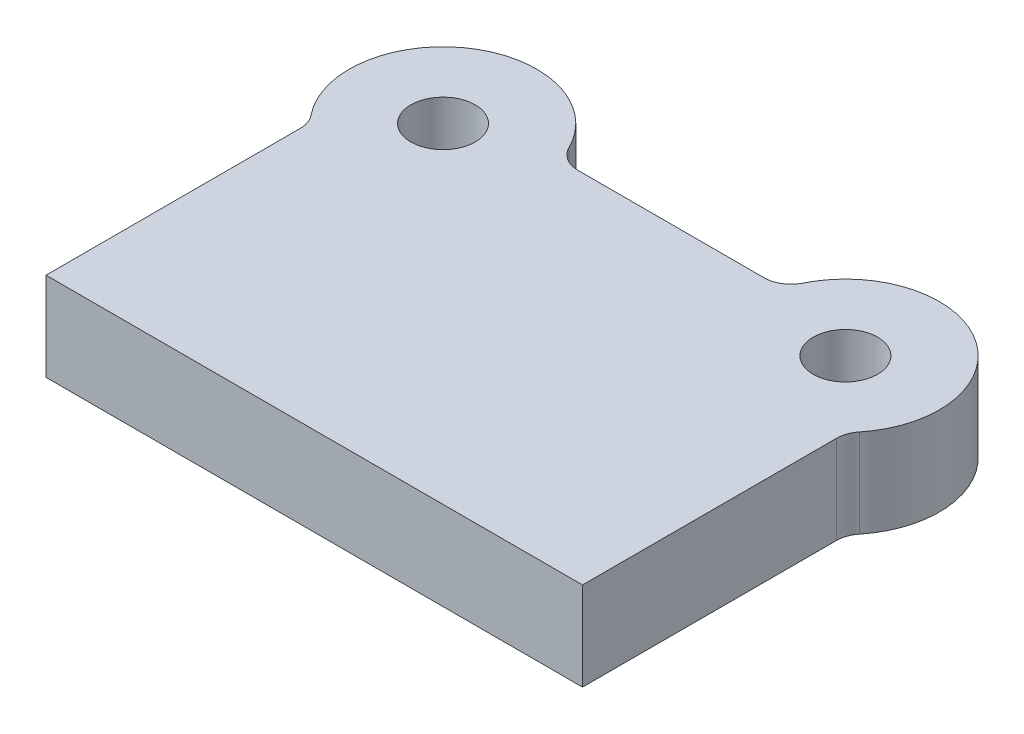
ISO-10303-21;
HEADER;
FILE_DESCRIPTION(('STEP AP214'),'2;1');
FILE_NAME('part.step','',(''),(''),'','','');
FILE_SCHEMA(('AUTOMOTIVE_DESIGN { 1 0 10303 214 1 1 1 1 }'));
ENDSEC;
DATA;
#1=APPLICATION_CONTEXT('core data for automotive mechanical design processes');
#2=APPLICATION_PROTOCOL_DEFINITION('international standard','automotive_design',2000,#1);
#3=PRODUCT_CONTEXT('',#1,'mechanical');
#4=PRODUCT('Part','Part','',(#3));
#5=PRODUCT_RELATED_PRODUCT_CATEGORY('part','',(#4));
#6=PRODUCT_DEFINITION_FORMATION('','',#4);
#7=PRODUCT_DEFINITION_CONTEXT('part definition',#1,'design');
#8=PRODUCT_DEFINITION('design','',#6,#7);
#9=PRODUCT_DEFINITION_SHAPE('','',#8);
#10=(LENGTH_UNIT() NAMED_UNIT(*) SI_UNIT(.MILLI.,.METRE.));
#11=(NAMED_UNIT(*) PLANE_ANGLE_UNIT() SI_UNIT($,.RADIAN.));
#12=(NAMED_UNIT(*) SI_UNIT($,.STERADIAN.) SOLID_ANGLE_UNIT());
#13=UNCERTAINTY_MEASURE_WITH_UNIT(LENGTH_MEASURE(1.E-05),#10,'distance_accuracy_value','');
#14=(GEOMETRIC_REPRESENTATION_CONTEXT(3) GLOBAL_UNCERTAINTY_ASSIGNED_CONTEXT((#13)) GLOBAL_UNIT_ASSIGNED_CONTEXT((#10,
#11,#12)) REPRESENTATION_CONTEXT('',''));
#15=CARTESIAN_POINT('',(0.,0.,0.));
#16=DIRECTION('',(0.,0.,1.));
#17=DIRECTION('',(1.,0.,0.));
#18=AXIS2_PLACEMENT_3D('',#15,#16,#17);
#19=CARTESIAN_POINT('',(-75.,33.,-123.));
#20=DIRECTION('',(0.,1.,0.));
#21=DIRECTION('',(0.,0.,1.));
#22=AXIS2_PLACEMENT_3D('',#19,#20,#21);
#23=PLANE('',#22);
#24=CARTESIAN_POINT('',(-75.,33.,-123.));
#25=DIRECTION('',(0.,1.,0.));
#26=DIRECTION('',(0.,0.,1.));
#27=AXIS2_PLACEMENT_3D('',#24,#25,#26);
#28=CIRCLE('',#27,12.);
#29=CARTESIAN_POINT('',(-75.,33.,-111.));
#30=VERTEX_POINT('',#29);
#31=EDGE_CURVE('E209',#30,#30,#28,.T.);
#32=ORIENTED_EDGE('',*,*,#31,.F.);
#33=EDGE_LOOP('',(#32));
#34=FACE_BOUND('',#33,.T.);
#35=CARTESIAN_POINT('',(-75.,33.,-123.));
#36=DIRECTION('',(0.,1.,0.));
#37=DIRECTION('',(0.,0.,1.));
#38=AXIS2_PLACEMENT_3D('',#35,#36,#37);
#39=CIRCLE('',#38,35.);
#40=CARTESIAN_POINT('',(-43.6467754232835,33.,-138.555555555556));
#41=VERTEX_POINT('',#40);
#42=CARTESIAN_POINT('',(-102.222222222222,33.,-101.001122363085));
#43=VERTEX_POINT('',#42);
#44=EDGE_CURVE('E152',#41,#43,#39,.T.);
#45=ORIENTED_EDGE('',*,*,#44,.T.);
#46=CARTESIAN_POINT('',(-110.,33.,-94.7157287525381));
#47=DIRECTION('',(0.,1.,0.));
#48=DIRECTION('',(0.,0.,1.));
#49=AXIS2_PLACEMENT_3D('',#46,#47,#48);
#50=CIRCLE('',#49,10.);
#51=CARTESIAN_POINT('',(-100.,33.,-94.7157287525381));
#52=VERTEX_POINT('',#51);
#53=EDGE_CURVE('E128',#43,#52,#50,.F.);
#54=ORIENTED_EDGE('',*,*,#53,.T.);
#55=DIRECTION('',(0.,0.,1.));
#56=VECTOR('',#55,1.);
#57=CARTESIAN_POINT('',(-100.,33.,0.));
#58=LINE('',#57,#56);
#59=CARTESIAN_POINT('',(-100.,33.,0.));
#60=VERTEX_POINT('',#59);
#61=EDGE_CURVE('E120',#52,#60,#58,.T.);
#62=ORIENTED_EDGE('',*,*,#61,.T.);
#63=DIRECTION('',(1.,0.,0.));
#64=VECTOR('',#63,1.);
#65=CARTESIAN_POINT('',(100.,33.,0.));
#66=LINE('',#65,#64);
#67=CARTESIAN_POINT('',(100.,33.,0.));
#68=VERTEX_POINT('',#67);
#69=EDGE_CURVE('E125',#60,#68,#66,.T.);
#70=ORIENTED_EDGE('',*,*,#69,.T.);
#71=DIRECTION('',(0.,0.,-1.));
#72=VECTOR('',#71,1.);
#73=CARTESIAN_POINT('',(100.,33.,0.));
#74=LINE('',#73,#72);
#75=CARTESIAN_POINT('',(100.,33.,-94.7157287525381));
#76=VERTEX_POINT('',#75);
#77=EDGE_CURVE('E142',#68,#76,#74,.T.);
#78=ORIENTED_EDGE('',*,*,#77,.T.);
#79=CARTESIAN_POINT('',(110.,33.,-94.7157287525381));
#80=DIRECTION('',(0.,1.,0.));
#81=DIRECTION('',(0.,0.,1.));
#82=AXIS2_PLACEMENT_3D('',#79,#80,#81);
#83=CIRCLE('',#82,10.);
#84=CARTESIAN_POINT('',(102.222222222222,33.,-101.001122363085));
#85=VERTEX_POINT('',#84);
#86=EDGE_CURVE('E176',#76,#85,#83,.F.);
#87=ORIENTED_EDGE('',*,*,#86,.T.);
#88=CARTESIAN_POINT('',(75.,33.,-123.));
#89=DIRECTION('',(0.,1.,0.));
#90=DIRECTION('',(0.,0.,-1.));
#91=AXIS2_PLACEMENT_3D('',#88,#89,#90);
#92=CIRCLE('',#91,35.);
#93=CARTESIAN_POINT('',(43.6467754232835,33.,-138.555555555556));
#94=VERTEX_POINT('',#93);
#95=EDGE_CURVE('E201',#85,#94,#92,.T.);
#96=ORIENTED_EDGE('',*,*,#95,.T.);
#97=CARTESIAN_POINT('',(34.6887112585073,33.,-143.));
#98=DIRECTION('',(0.,1.,0.));
#99=DIRECTION('',(0.,0.,1.));
#100=AXIS2_PLACEMENT_3D('',#97,#98,#99);
#101=CIRCLE('',#100,10.);
#102=CARTESIAN_POINT('',(34.6887112585073,33.,-133.));
#103=VERTEX_POINT('',#102);
#104=EDGE_CURVE('E13',#94,#103,#101,.F.);
#105=ORIENTED_EDGE('',*,*,#104,.T.);
#106=DIRECTION('',(-1.,0.,0.));
#107=VECTOR('',#106,1.);
#108=CARTESIAN_POINT('',(41.4589803375032,33.,-133.));
#109=LINE('',#108,#107);
#110=CARTESIAN_POINT('',(-34.6887112585073,33.,-133.));
#111=VERTEX_POINT('',#110);
#112=EDGE_CURVE('E199',#103,#111,#109,.T.);
#113=ORIENTED_EDGE('',*,*,#112,.T.);
#114=CARTESIAN_POINT('',(-34.6887112585073,33.,-143.));
#115=DIRECTION('',(0.,1.,0.));
#116=DIRECTION('',(0.,0.,1.));
#117=AXIS2_PLACEMENT_3D('',#114,#115,#116);
#118=CIRCLE('',#117,10.);
#119=EDGE_CURVE('E180',#111,#41,#118,.F.);
#120=ORIENTED_EDGE('',*,*,#119,.T.);
#121=EDGE_LOOP('',(#45,#54,#62,#70,#78,#87,#96,#105,#113,#120));
#122=FACE_BOUND('',#121,.T.);
#123=CARTESIAN_POINT('',(75.,33.,-123.));
#124=DIRECTION('',(0.,1.,0.));
#125=DIRECTION('',(0.,0.,-1.));
#126=AXIS2_PLACEMENT_3D('',#123,#124,#125);
#127=CIRCLE('',#126,12.);
#128=CARTESIAN_POINT('',(75.,33.,-135.));
#129=VERTEX_POINT('',#128);
#130=EDGE_CURVE('E231',#129,#129,#127,.T.);
#131=ORIENTED_EDGE('',*,*,#130,.F.);
#132=EDGE_LOOP('',(#131));
#133=FACE_BOUND('',#132,.T.);
#134=ADVANCED_FACE('F45',(#34,#122,#133),#23,.T.);
#135=CARTESIAN_POINT('',(-75.,0.,-123.));
#136=DIRECTION('',(0.,1.,0.));
#137=DIRECTION('',(0.,0.,1.));
#138=AXIS2_PLACEMENT_3D('',#135,#136,#137);
#139=PLANE('',#138);
#140=DIRECTION('',(0.,0.,1.));
#141=VECTOR('',#140,1.);
#142=CARTESIAN_POINT('',(-100.,0.,0.));
#143=LINE('',#142,#141);
#144=CARTESIAN_POINT('',(-100.,0.,-94.7157287525381));
#145=VERTEX_POINT('',#144);
#146=CARTESIAN_POINT('',(-100.,0.,0.));
#147=VERTEX_POINT('',#146);
#148=EDGE_CURVE('E146',#145,#147,#143,.T.);
#149=ORIENTED_EDGE('',*,*,#148,.F.);
#150=CARTESIAN_POINT('',(-110.,0.,-94.7157287525381));
#151=DIRECTION('',(0.,1.,0.));
#152=DIRECTION('',(0.,0.,1.));
#153=AXIS2_PLACEMENT_3D('',#150,#151,#152);
#154=CIRCLE('',#153,10.);
#155=CARTESIAN_POINT('',(-102.222222222222,0.,-101.001122363085));
#156=VERTEX_POINT('',#155);
#157=EDGE_CURVE('E171',#145,#156,#154,.T.);
#158=ORIENTED_EDGE('',*,*,#157,.T.);
#159=CARTESIAN_POINT('',(-75.,0.,-123.));
#160=DIRECTION('',(0.,1.,0.));
#161=DIRECTION('',(0.,0.,1.));
#162=AXIS2_PLACEMENT_3D('',#159,#160,#161);
#163=CIRCLE('',#162,35.);
#164=CARTESIAN_POINT('',(-43.6467754232835,0.,-138.555555555556));
#165=VERTEX_POINT('',#164);
#166=EDGE_CURVE('E133',#165,#156,#163,.T.);
#167=ORIENTED_EDGE('',*,*,#166,.F.);
#168=CARTESIAN_POINT('',(-34.6887112585073,0.,-143.));
#169=DIRECTION('',(0.,1.,0.));
#170=DIRECTION('',(0.,0.,1.));
#171=AXIS2_PLACEMENT_3D('',#168,#169,#170);
#172=CIRCLE('',#171,10.);
#173=CARTESIAN_POINT('',(-34.6887112585073,0.,-133.));
#174=VERTEX_POINT('',#173);
#175=EDGE_CURVE('E178',#165,#174,#172,.T.);
#176=ORIENTED_EDGE('',*,*,#175,.T.);
#177=DIRECTION('',(-1.,0.,0.));
#178=VECTOR('',#177,1.);
#179=CARTESIAN_POINT('',(41.4589803375032,0.,-133.));
#180=LINE('',#179,#178);
#181=CARTESIAN_POINT('',(34.6887112585073,0.,-133.));
#182=VERTEX_POINT('',#181);
#183=EDGE_CURVE('E188',#182,#174,#180,.T.);
#184=ORIENTED_EDGE('',*,*,#183,.F.);
#185=CARTESIAN_POINT('',(34.6887112585073,0.,-143.));
#186=DIRECTION('',(0.,1.,0.));
#187=DIRECTION('',(0.,0.,1.));
#188=AXIS2_PLACEMENT_3D('',#185,#186,#187);
#189=CIRCLE('',#188,10.);
#190=CARTESIAN_POINT('',(43.6467754232835,0.,-138.555555555556));
#191=VERTEX_POINT('',#190);
#192=EDGE_CURVE('E53',#182,#191,#189,.T.);
#193=ORIENTED_EDGE('',*,*,#192,.T.);
#194=CARTESIAN_POINT('',(75.,0.,-123.));
#195=DIRECTION('',(0.,1.,0.));
#196=DIRECTION('',(0.,0.,-1.));
#197=AXIS2_PLACEMENT_3D('',#194,#195,#196);
#198=CIRCLE('',#197,35.);
#199=CARTESIAN_POINT('',(102.222222222222,0.,-101.001122363085));
#200=VERTEX_POINT('',#199);
#201=EDGE_CURVE('E187',#200,#191,#198,.T.);
#202=ORIENTED_EDGE('',*,*,#201,.F.);
#203=CARTESIAN_POINT('',(110.,0.,-94.7157287525381));
#204=DIRECTION('',(0.,1.,0.));
#205=DIRECTION('',(0.,0.,1.));
#206=AXIS2_PLACEMENT_3D('',#203,#204,#205);
#207=CIRCLE('',#206,10.);
#208=CARTESIAN_POINT('',(100.,0.,-94.7157287525381));
#209=VERTEX_POINT('',#208);
#210=EDGE_CURVE('E174',#200,#209,#207,.T.);
#211=ORIENTED_EDGE('',*,*,#210,.T.);
#212=DIRECTION('',(0.,0.,-1.));
#213=VECTOR('',#212,1.);
#214=CARTESIAN_POINT('',(100.,0.,0.));
#215=LINE('',#214,#213);
#216=CARTESIAN_POINT('',(100.,0.,0.));
#217=VERTEX_POINT('',#216);
#218=EDGE_CURVE('E196',#217,#209,#215,.T.);
#219=ORIENTED_EDGE('',*,*,#218,.F.);
#220=DIRECTION('',(1.,0.,0.));
#221=VECTOR('',#220,1.);
#222=CARTESIAN_POINT('',(100.,0.,0.));
#223=LINE('',#222,#221);
#224=EDGE_CURVE('E208',#147,#217,#223,.T.);
#225=ORIENTED_EDGE('',*,*,#224,.F.);
#226=EDGE_LOOP('',(#149,#158,#167,#176,#184,#193,#202,#211,#219,#225));
#227=FACE_BOUND('',#226,.T.);
#228=CARTESIAN_POINT('',(-75.,0.,-123.));
#229=DIRECTION('',(0.,1.,0.));
#230=DIRECTION('',(0.,0.,1.));
#231=AXIS2_PLACEMENT_3D('',#228,#229,#230);
#232=CIRCLE('',#231,12.);
#233=CARTESIAN_POINT('',(-75.,0.,-111.));
#234=VERTEX_POINT('',#233);
#235=EDGE_CURVE('E228',#234,#234,#232,.T.);
#236=ORIENTED_EDGE('',*,*,#235,.T.);
#237=EDGE_LOOP('',(#236));
#238=FACE_BOUND('',#237,.T.);
#239=CARTESIAN_POINT('',(75.,0.,-123.));
#240=DIRECTION('',(0.,1.,0.));
#241=DIRECTION('',(0.,0.,-1.));
#242=AXIS2_PLACEMENT_3D('',#239,#240,#241);
#243=CIRCLE('',#242,12.);
#244=CARTESIAN_POINT('',(75.,0.,-135.));
#245=VERTEX_POINT('',#244);
#246=EDGE_CURVE('E234',#245,#245,#243,.T.);
#247=ORIENTED_EDGE('',*,*,#246,.T.);
#248=EDGE_LOOP('',(#247));
#249=FACE_BOUND('',#248,.T.);
#250=ADVANCED_FACE('F185',(#227,#238,#249),#139,.F.);
#251=CARTESIAN_POINT('',(-100.,33.,0.));
#252=DIRECTION('',(1.,0.,0.));
#253=DIRECTION('',(0.,0.,-1.));
#254=AXIS2_PLACEMENT_3D('',#251,#252,#253);
#255=PLANE('',#254);
#256=ORIENTED_EDGE('',*,*,#61,.F.);
#257=DIRECTION('',(0.,1.,0.));
#258=VECTOR('',#257,1.);
#259=CARTESIAN_POINT('',(-100.,0.,-94.7157287525381));
#260=LINE('',#259,#258);
#261=EDGE_CURVE('E148',#52,#145,#260,.F.);
#262=ORIENTED_EDGE('',*,*,#261,.T.);
#263=ORIENTED_EDGE('',*,*,#148,.T.);
#264=DIRECTION('',(0.,-1.,0.));
#265=VECTOR('',#264,1.);
#266=CARTESIAN_POINT('',(-100.,33.,0.));
#267=LINE('',#266,#265);
#268=EDGE_CURVE('E138',#60,#147,#267,.T.);
#269=ORIENTED_EDGE('',*,*,#268,.F.);
#270=EDGE_LOOP('',(#256,#262,#263,#269));
#271=FACE_BOUND('',#270,.T.);
#272=ADVANCED_FACE('F144',(#271),#255,.F.);
#273=CARTESIAN_POINT('',(100.,33.,0.));
#274=DIRECTION('',(0.,0.,-1.));
#275=DIRECTION('',(-1.,0.,0.));
#276=AXIS2_PLACEMENT_3D('',#273,#274,#275);
#277=PLANE('',#276);
#278=ORIENTED_EDGE('',*,*,#224,.T.);
#279=DIRECTION('',(0.,-1.,0.));
#280=VECTOR('',#279,1.);
#281=CARTESIAN_POINT('',(100.,33.,0.));
#282=LINE('',#281,#280);
#283=EDGE_CURVE('E140',#68,#217,#282,.T.);
#284=ORIENTED_EDGE('',*,*,#283,.F.);
#285=ORIENTED_EDGE('',*,*,#69,.F.);
#286=ORIENTED_EDGE('',*,*,#268,.T.);
#287=EDGE_LOOP('',(#278,#284,#285,#286));
#288=FACE_BOUND('',#287,.T.);
#289=ADVANCED_FACE('F137',(#288),#277,.F.);
#290=CARTESIAN_POINT('',(100.,33.,0.));
#291=DIRECTION('',(-1.,0.,0.));
#292=DIRECTION('',(0.,0.,1.));
#293=AXIS2_PLACEMENT_3D('',#290,#291,#292);
#294=PLANE('',#293);
#295=ORIENTED_EDGE('',*,*,#218,.T.);
#296=DIRECTION('',(0.,1.,0.));
#297=VECTOR('',#296,1.);
#298=CARTESIAN_POINT('',(100.,33.,-94.7157287525381));
#299=LINE('',#298,#297);
#300=EDGE_CURVE('E165',#209,#76,#299,.T.);
#301=ORIENTED_EDGE('',*,*,#300,.T.);
#302=ORIENTED_EDGE('',*,*,#77,.F.);
#303=ORIENTED_EDGE('',*,*,#283,.T.);
#304=EDGE_LOOP('',(#295,#301,#302,#303));
#305=FACE_BOUND('',#304,.T.);
#306=ADVANCED_FACE('F224',(#305),#294,.F.);
#307=CARTESIAN_POINT('',(75.,33.,-123.));
#308=DIRECTION('',(0.,-1.,0.));
#309=DIRECTION('',(0.,0.,-1.));
#310=AXIS2_PLACEMENT_3D('',#307,#308,#309);
#311=CYLINDRICAL_SURFACE('',#310,35.);
#312=ORIENTED_EDGE('',*,*,#95,.F.);
#313=DIRECTION('',(0.,-1.,0.));
#314=VECTOR('',#313,1.);
#315=CARTESIAN_POINT('',(102.222222222222,33.,-101.001122363085));
#316=LINE('',#315,#314);
#317=EDGE_CURVE('E162',#85,#200,#316,.T.);
#318=ORIENTED_EDGE('',*,*,#317,.T.);
#319=ORIENTED_EDGE('',*,*,#201,.T.);
#320=DIRECTION('',(0.,-1.,0.));
#321=VECTOR('',#320,1.);
#322=CARTESIAN_POINT('',(43.6467754232834,33.,-138.555555555556));
#323=LINE('',#322,#321);
#324=EDGE_CURVE('E160',#191,#94,#323,.F.);
#325=ORIENTED_EDGE('',*,*,#324,.T.);
#326=EDGE_LOOP('',(#312,#318,#319,#325));
#327=FACE_BOUND('',#326,.T.);
#328=ADVANCED_FACE('F194',(#327),#311,.T.);
#329=CARTESIAN_POINT('',(41.4589803375032,33.,-133.));
#330=DIRECTION('',(0.,0.,1.));
#331=DIRECTION('',(1.,0.,0.));
#332=AXIS2_PLACEMENT_3D('',#329,#330,#331);
#333=PLANE('',#332);
#334=ORIENTED_EDGE('',*,*,#183,.T.);
#335=DIRECTION('',(0.,1.,0.));
#336=VECTOR('',#335,1.);
#337=CARTESIAN_POINT('',(-34.6887112585073,33.,-133.));
#338=LINE('',#337,#336);
#339=EDGE_CURVE('E60',#174,#111,#338,.T.);
#340=ORIENTED_EDGE('',*,*,#339,.T.);
#341=ORIENTED_EDGE('',*,*,#112,.F.);
#342=DIRECTION('',(0.,1.,0.));
#343=VECTOR('',#342,1.);
#344=CARTESIAN_POINT('',(34.6887112585073,0.,-133.));
#345=LINE('',#344,#343);
#346=EDGE_CURVE('E167',#103,#182,#345,.F.);
#347=ORIENTED_EDGE('',*,*,#346,.T.);
#348=EDGE_LOOP('',(#334,#340,#341,#347));
#349=FACE_BOUND('',#348,.T.);
#350=ADVANCED_FACE('F198',(#349),#333,.F.);
#351=CARTESIAN_POINT('',(-75.,33.,-123.));
#352=DIRECTION('',(0.,-1.,0.));
#353=DIRECTION('',(0.,0.,-1.));
#354=AXIS2_PLACEMENT_3D('',#351,#352,#353);
#355=CYLINDRICAL_SURFACE('',#354,35.);
#356=ORIENTED_EDGE('',*,*,#166,.T.);
#357=DIRECTION('',(0.,-1.,0.));
#358=VECTOR('',#357,1.);
#359=CARTESIAN_POINT('',(-102.222222222222,33.,-101.001122363085));
#360=LINE('',#359,#358);
#361=EDGE_CURVE('E158',#156,#43,#360,.F.);
#362=ORIENTED_EDGE('',*,*,#361,.T.);
#363=ORIENTED_EDGE('',*,*,#44,.F.);
#364=DIRECTION('',(0.,-1.,0.));
#365=VECTOR('',#364,1.);
#366=CARTESIAN_POINT('',(-43.6467754232834,33.,-138.555555555556));
#367=LINE('',#366,#365);
#368=EDGE_CURVE('E150',#41,#165,#367,.T.);
#369=ORIENTED_EDGE('',*,*,#368,.T.);
#370=EDGE_LOOP('',(#356,#362,#363,#369));
#371=FACE_BOUND('',#370,.T.);
#372=ADVANCED_FACE('F217',(#371),#355,.T.);
#373=CARTESIAN_POINT('',(-75.,33.,-123.));
#374=DIRECTION('',(0.,-1.,0.));
#375=DIRECTION('',(0.,0.,-1.));
#376=AXIS2_PLACEMENT_3D('',#373,#374,#375);
#377=CYLINDRICAL_SURFACE('',#376,12.);
#378=ORIENTED_EDGE('',*,*,#31,.T.);
#379=EDGE_LOOP('',(#378));
#380=FACE_BOUND('',#379,.T.);
#381=ORIENTED_EDGE('',*,*,#235,.F.);
#382=EDGE_LOOP('',(#381));
#383=FACE_BOUND('',#382,.T.);
#384=ADVANCED_FACE('F251',(#380,#383),#377,.F.);
#385=CARTESIAN_POINT('',(75.,33.,-123.));
#386=DIRECTION('',(0.,-1.,0.));
#387=DIRECTION('',(0.,0.,-1.));
#388=AXIS2_PLACEMENT_3D('',#385,#386,#387);
#389=CYLINDRICAL_SURFACE('',#388,12.);
#390=ORIENTED_EDGE('',*,*,#130,.T.);
#391=EDGE_LOOP('',(#390));
#392=FACE_BOUND('',#391,.T.);
#393=ORIENTED_EDGE('',*,*,#246,.F.);
#394=EDGE_LOOP('',(#393));
#395=FACE_BOUND('',#394,.T.);
#396=ADVANCED_FACE('F240',(#392,#395),#389,.F.);
#397=CARTESIAN_POINT('',(-110.,33.,-94.7157287525381));
#398=DIRECTION('',(0.,-1.,0.));
#399=DIRECTION('',(0.,0.,-1.));
#400=AXIS2_PLACEMENT_3D('',#397,#398,#399);
#401=CYLINDRICAL_SURFACE('',#400,10.);
#402=ORIENTED_EDGE('',*,*,#53,.F.);
#403=ORIENTED_EDGE('',*,*,#361,.F.);
#404=ORIENTED_EDGE('',*,*,#157,.F.);
#405=ORIENTED_EDGE('',*,*,#261,.F.);
#406=EDGE_LOOP('',(#402,#403,#404,#405));
#407=FACE_BOUND('',#406,.T.);
#408=ADVANCED_FACE('F221',(#407),#401,.F.);
#409=CARTESIAN_POINT('',(110.,33.,-94.7157287525381));
#410=DIRECTION('',(0.,-1.,0.));
#411=DIRECTION('',(0.,0.,-1.));
#412=AXIS2_PLACEMENT_3D('',#409,#410,#411);
#413=CYLINDRICAL_SURFACE('',#412,10.);
#414=ORIENTED_EDGE('',*,*,#86,.F.);
#415=ORIENTED_EDGE('',*,*,#300,.F.);
#416=ORIENTED_EDGE('',*,*,#210,.F.);
#417=ORIENTED_EDGE('',*,*,#317,.F.);
#418=EDGE_LOOP('',(#414,#415,#416,#417));
#419=FACE_BOUND('',#418,.T.);
#420=ADVANCED_FACE('F268',(#419),#413,.F.);
#421=CARTESIAN_POINT('',(-34.6887112585073,33.,-143.));
#422=DIRECTION('',(0.,-1.,0.));
#423=DIRECTION('',(0.,0.,-1.));
#424=AXIS2_PLACEMENT_3D('',#421,#422,#423);
#425=CYLINDRICAL_SURFACE('',#424,10.);
#426=ORIENTED_EDGE('',*,*,#119,.F.);
#427=ORIENTED_EDGE('',*,*,#339,.F.);
#428=ORIENTED_EDGE('',*,*,#175,.F.);
#429=ORIENTED_EDGE('',*,*,#368,.F.);
#430=EDGE_LOOP('',(#426,#427,#428,#429));
#431=FACE_BOUND('',#430,.T.);
#432=ADVANCED_FACE('F270',(#431),#425,.F.);
#433=CARTESIAN_POINT('',(34.6887112585073,33.,-143.));
#434=DIRECTION('',(0.,-1.,0.));
#435=DIRECTION('',(0.,0.,-1.));
#436=AXIS2_PLACEMENT_3D('',#433,#434,#435);
#437=CYLINDRICAL_SURFACE('',#436,10.);
#438=ORIENTED_EDGE('',*,*,#104,.F.);
#439=ORIENTED_EDGE('',*,*,#324,.F.);
#440=ORIENTED_EDGE('',*,*,#192,.F.);
#441=ORIENTED_EDGE('',*,*,#346,.F.);
#442=EDGE_LOOP('',(#438,#439,#440,#441));
#443=FACE_BOUND('',#442,.T.);
#444=ADVANCED_FACE('F47',(#443),#437,.F.);
#445=CLOSED_SHELL('',(#134,#250,#272,#289,#306,#328,#350,#372,#384,#396,#408,#420,#432,#444));
#446=MANIFOLD_SOLID_BREP('B2',#445);
#447=ADVANCED_BREP_SHAPE_REPRESENTATION('',(#18,#446),#14);
#448=SHAPE_DEFINITION_REPRESENTATION(#9,#447);
ENDSEC;
END-ISO-10303-21;
